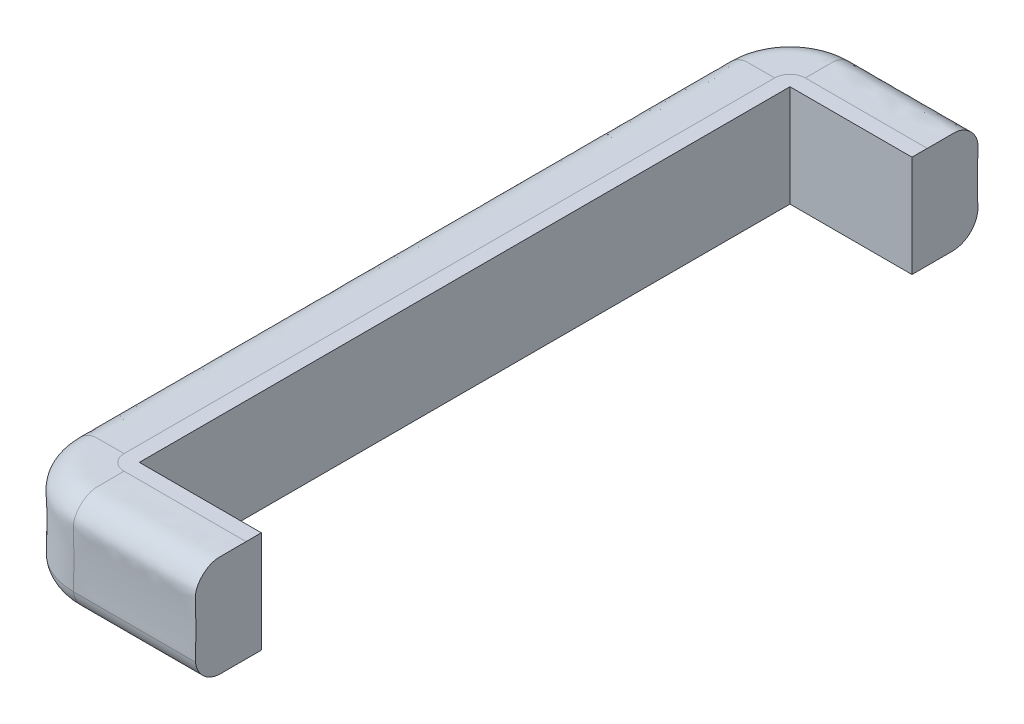
ISO-10303-21;
HEADER;
FILE_DESCRIPTION(('STEP AP214'),'2;1');
FILE_NAME('part.step','',(''),(''),'','','');
FILE_SCHEMA(('AUTOMOTIVE_DESIGN { 1 0 10303 214 1 1 1 1 }'));
ENDSEC;
DATA;
#1=APPLICATION_CONTEXT('core data for automotive mechanical design processes');
#2=APPLICATION_PROTOCOL_DEFINITION('international standard','automotive_design',2000,#1);
#3=PRODUCT_CONTEXT('',#1,'mechanical');
#4=PRODUCT('Part','Part','',(#3));
#5=PRODUCT_RELATED_PRODUCT_CATEGORY('part','',(#4));
#6=PRODUCT_DEFINITION_FORMATION('','',#4);
#7=PRODUCT_DEFINITION_CONTEXT('part definition',#1,'design');
#8=PRODUCT_DEFINITION('design','',#6,#7);
#9=PRODUCT_DEFINITION_SHAPE('','',#8);
#10=(LENGTH_UNIT() NAMED_UNIT(*) SI_UNIT(.MILLI.,.METRE.));
#11=(NAMED_UNIT(*) PLANE_ANGLE_UNIT() SI_UNIT($,.RADIAN.));
#12=(NAMED_UNIT(*) SI_UNIT($,.STERADIAN.) SOLID_ANGLE_UNIT());
#13=UNCERTAINTY_MEASURE_WITH_UNIT(LENGTH_MEASURE(1.E-05),#10,'distance_accuracy_value','');
#14=(GEOMETRIC_REPRESENTATION_CONTEXT(3) GLOBAL_UNCERTAINTY_ASSIGNED_CONTEXT((#13)) GLOBAL_UNIT_ASSIGNED_CONTEXT((#10,
#11,#12)) REPRESENTATION_CONTEXT('',''));
#15=CARTESIAN_POINT('',(0.,0.,0.));
#16=DIRECTION('',(0.,0.,1.));
#17=DIRECTION('',(1.,0.,0.));
#18=AXIS2_PLACEMENT_3D('',#15,#16,#17);
#19=CARTESIAN_POINT('',(0.,0.,812.8));
#20=DIRECTION('',(-1.,0.,0.));
#21=DIRECTION('',(0.,-1.,0.));
#22=AXIS2_PLACEMENT_3D('',#19,#20,#21);
#23=PLANE('',#22);
#24=DIRECTION('',(0.,-1.,0.));
#25=VECTOR('',#24,1.);
#26=CARTESIAN_POINT('',(0.,0.,0.));
#27=LINE('',#26,#25);
#28=CARTESIAN_POINT('',(0.,127.,0.));
#29=VERTEX_POINT('',#28);
#30=CARTESIAN_POINT('',(0.,0.,0.));
#31=VERTEX_POINT('',#30);
#32=EDGE_CURVE('E56',#29,#31,#27,.T.);
#33=ORIENTED_EDGE('',*,*,#32,.F.);
#34=DIRECTION('',(0.,0.,-1.));
#35=VECTOR('',#34,1.);
#36=CARTESIAN_POINT('',(0.,127.,812.8));
#37=LINE('',#36,#35);
#38=CARTESIAN_POINT('',(0.,127.,812.8));
#39=VERTEX_POINT('',#38);
#40=EDGE_CURVE('E173',#39,#29,#37,.T.);
#41=ORIENTED_EDGE('',*,*,#40,.F.);
#42=DIRECTION('',(0.,-1.,0.));
#43=VECTOR('',#42,1.);
#44=CARTESIAN_POINT('',(0.,0.,812.8));
#45=LINE('',#44,#43);
#46=CARTESIAN_POINT('',(0.,0.,812.8));
#47=VERTEX_POINT('',#46);
#48=EDGE_CURVE('E174',#39,#47,#45,.T.);
#49=ORIENTED_EDGE('',*,*,#48,.T.);
#50=DIRECTION('',(0.,0.,-1.));
#51=VECTOR('',#50,1.);
#52=CARTESIAN_POINT('',(0.,0.,812.8));
#53=LINE('',#52,#51);
#54=EDGE_CURVE('E52',#47,#31,#53,.T.);
#55=ORIENTED_EDGE('',*,*,#54,.T.);
#56=EDGE_LOOP('',(#33,#41,#49,#55));
#57=FACE_BOUND('',#56,.T.);
#58=ADVANCED_FACE('F36',(#57),#23,.F.);
#59=CARTESIAN_POINT('',(-19.05,127.,812.8));
#60=CARTESIAN_POINT('',(-25.8551548912427,127.,812.8));
#61=CARTESIAN_POINT('',(-41.6978192217573,126.779099710224,812.8));
#62=CARTESIAN_POINT('',(-65.8750714159513,127.401952543473,812.8));
#63=CARTESIAN_POINT('',(-83.5455443579168,110.861586710119,812.8));
#64=CARTESIAN_POINT('',(-81.483021395839,80.6655289043063,812.8));
#65=CARTESIAN_POINT('',(-81.4887588319644,44.9734172297453,812.8));
#66=CARTESIAN_POINT('',(-83.2203444761149,14.9744583315502,812.8));
#67=CARTESIAN_POINT('',(-68.5084229386176,-0.376359178511223,812.8));
#68=CARTESIAN_POINT('',(-39.2535015128502,0.21290615922689,812.8));
#69=CARTESIAN_POINT('',(-30.1777356571068,0.179241264312297,812.8));
#70=CARTESIAN_POINT('',(-19.0499999999995,0.,812.8));
#71=B_SPLINE_CURVE_WITH_KNOTS('',3,(#59,#60,#61,#62,#63,#64,#65,#66,#67,#68,#69,#70),
.UNSPECIFIED.,.F.,.F.,(4,1,1,1,1,1,1,1,1,4),(0.,0.126865214049549,0.164017914659121,
0.348470440380542,0.398266481918078,0.612182288496949,0.660910622989208,0.836821492348413,
0.872929315916482,1.),.UNSPECIFIED.);
#72=DIRECTION('',(0.,0.,-1.));
#73=VECTOR('',#72,1.);
#74=SURFACE_OF_LINEAR_EXTRUSION('',#71,#73);
#75=CARTESIAN_POINT('',(-19.05,127.,0.));
#76=CARTESIAN_POINT('',(-25.8551548912427,127.,0.));
#77=CARTESIAN_POINT('',(-41.6978192217573,126.779099710224,0.));
#78=CARTESIAN_POINT('',(-65.8750714159513,127.401952543473,0.));
#79=CARTESIAN_POINT('',(-83.5455443579168,110.861586710119,0.));
#80=CARTESIAN_POINT('',(-81.483021395839,80.6655289043063,0.));
#81=CARTESIAN_POINT('',(-81.4887588319644,44.9734172297453,0.));
#82=CARTESIAN_POINT('',(-83.2203444761149,14.9744583315502,0.));
#83=CARTESIAN_POINT('',(-68.5084229386176,-0.376359178511223,0.));
#84=CARTESIAN_POINT('',(-39.2535015128502,0.21290615922689,0.));
#85=CARTESIAN_POINT('',(-30.1777356571068,0.179241264312297,0.));
#86=CARTESIAN_POINT('',(-19.0499999999995,0.,0.));
#87=B_SPLINE_CURVE_WITH_KNOTS('',3,(#75,#76,#77,#78,#79,#80,#81,#82,#83,#84,#85,#86),
.UNSPECIFIED.,.F.,.F.,(4,1,1,1,1,1,1,1,1,4),(0.,0.126865214049549,0.164017914659121,
0.348470440380542,0.398266481918078,0.612182288496949,0.660910622989208,0.836821492348413,
0.872929315916482,1.),.UNSPECIFIED.);
#88=CARTESIAN_POINT('',(-19.05,127.,0.));
#89=VERTEX_POINT('',#88);
#90=CARTESIAN_POINT('',(-82.3555386809632,28.2413708440135,0.));
#91=VERTEX_POINT('',#90);
#92=EDGE_CURVE('E293',#89,#91,#87,.T.);
#93=ORIENTED_EDGE('',*,*,#92,.T.);
#94=DIRECTION('',(0.,0.,-1.));
#95=VECTOR('',#94,1.);
#96=CARTESIAN_POINT('',(-82.3555386809632,28.2413708440135,812.8));
#97=LINE('',#96,#95);
#98=CARTESIAN_POINT('',(-82.3555386809632,28.2413708440135,812.8));
#99=VERTEX_POINT('',#98);
#100=EDGE_CURVE('E11',#99,#91,#97,.T.);
#101=ORIENTED_EDGE('',*,*,#100,.F.);
#102=CARTESIAN_POINT('',(-19.05,127.,812.8));
#103=VERTEX_POINT('',#102);
#104=EDGE_CURVE('E294',#103,#99,#71,.T.);
#105=ORIENTED_EDGE('',*,*,#104,.F.);
#106=DIRECTION('',(0.,0.,-1.));
#107=VECTOR('',#106,1.);
#108=CARTESIAN_POINT('',(-19.05,127.,812.8));
#109=LINE('',#108,#107);
#110=EDGE_CURVE('E312',#103,#89,#109,.T.);
#111=ORIENTED_EDGE('',*,*,#110,.T.);
#112=EDGE_LOOP('',(#93,#101,#105,#111));
#113=FACE_BOUND('',#112,.T.);
#114=ADVANCED_FACE('F38',(#113),#74,.F.);
#115=CARTESIAN_POINT('',(-50.8,31.75,812.8));
#116=DIRECTION('',(0.,0.,-1.));
#117=DIRECTION('',(-1.,0.,0.));
#118=AXIS2_PLACEMENT_3D('',#115,#116,#117);
#119=CYLINDRICAL_SURFACE('',#118,31.75);
#120=CARTESIAN_POINT('',(-50.8,31.75,0.));
#121=DIRECTION('',(0.,0.,1.));
#122=DIRECTION('',(1.,0.,0.));
#123=AXIS2_PLACEMENT_3D('',#120,#121,#122);
#124=CIRCLE('',#123,31.75);
#125=CARTESIAN_POINT('',(-50.8,0.,0.));
#126=VERTEX_POINT('',#125);
#127=EDGE_CURVE('E590',#91,#126,#124,.T.);
#128=ORIENTED_EDGE('',*,*,#127,.T.);
#129=DIRECTION('',(0.,0.,-1.));
#130=VECTOR('',#129,1.);
#131=CARTESIAN_POINT('',(-50.8,0.,812.8));
#132=LINE('',#131,#130);
#133=CARTESIAN_POINT('',(-50.8,0.,812.8));
#134=VERTEX_POINT('',#133);
#135=EDGE_CURVE('E45',#134,#126,#132,.T.);
#136=ORIENTED_EDGE('',*,*,#135,.F.);
#137=CARTESIAN_POINT('',(-50.8,31.75,812.8));
#138=DIRECTION('',(0.,0.,1.));
#139=DIRECTION('',(1.,0.,0.));
#140=AXIS2_PLACEMENT_3D('',#137,#138,#139);
#141=CIRCLE('',#140,31.75);
#142=EDGE_CURVE('E300',#99,#134,#141,.T.);
#143=ORIENTED_EDGE('',*,*,#142,.F.);
#144=ORIENTED_EDGE('',*,*,#100,.T.);
#145=EDGE_LOOP('',(#128,#136,#143,#144));
#146=FACE_BOUND('',#145,.T.);
#147=ADVANCED_FACE('F324',(#146),#119,.T.);
#148=CARTESIAN_POINT('',(-19.05,127.,812.8));
#149=CARTESIAN_POINT('',(-25.8551548912427,127.,812.8));
#150=CARTESIAN_POINT('',(-41.6978192217573,126.779099710224,812.8));
#151=CARTESIAN_POINT('',(-65.8750714159513,127.401952543473,812.8));
#152=CARTESIAN_POINT('',(-83.5455443579168,110.861586710119,812.8));
#153=CARTESIAN_POINT('',(-81.483021395839,80.6655289043063,812.8));
#154=CARTESIAN_POINT('',(-81.4887588319644,44.9734172297453,812.8));
#155=CARTESIAN_POINT('',(-83.2203444761149,14.9744583315502,812.8));
#156=CARTESIAN_POINT('',(-68.5084229386176,-0.376359178511223,812.8));
#157=CARTESIAN_POINT('',(-39.2535015128502,0.21290615922689,812.8));
#158=CARTESIAN_POINT('',(-30.1777356571068,0.179241264312297,812.8));
#159=CARTESIAN_POINT('',(-19.0499999999995,0.,812.8));
#160=B_SPLINE_CURVE_WITH_KNOTS('',3,(#148,#149,#150,#151,#152,#153,#154,#155,#156,#157,#158,
#159),.UNSPECIFIED.,.F.,.F.,(4,1,1,1,1,1,1,1,1,4),(0.,0.126865214049549,0.164017914659121,
0.348470440380542,0.398266481918078,0.612182288496949,0.660910622989208,0.836821492348413,
0.872929315916482,1.),.UNSPECIFIED.);
#161=DIRECTION('',(0.,0.,-1.));
#162=VECTOR('',#161,1.);
#163=SURFACE_OF_LINEAR_EXTRUSION('',#160,#162);
#164=CARTESIAN_POINT('',(-19.05,127.,0.));
#165=CARTESIAN_POINT('',(-25.8551548912427,127.,0.));
#166=CARTESIAN_POINT('',(-41.6978192217573,126.779099710224,0.));
#167=CARTESIAN_POINT('',(-65.8750714159513,127.401952543473,0.));
#168=CARTESIAN_POINT('',(-83.5455443579168,110.861586710119,0.));
#169=CARTESIAN_POINT('',(-81.483021395839,80.6655289043063,0.));
#170=CARTESIAN_POINT('',(-81.4887588319644,44.9734172297453,0.));
#171=CARTESIAN_POINT('',(-83.2203444761149,14.9744583315502,0.));
#172=CARTESIAN_POINT('',(-68.5084229386176,-0.376359178511223,0.));
#173=CARTESIAN_POINT('',(-39.2535015128502,0.21290615922689,0.));
#174=CARTESIAN_POINT('',(-30.1777356571068,0.179241264312297,0.));
#175=CARTESIAN_POINT('',(-19.0499999999995,0.,0.));
#176=B_SPLINE_CURVE_WITH_KNOTS('',3,(#164,#165,#166,#167,#168,#169,#170,#171,#172,#173,#174,
#175),.UNSPECIFIED.,.F.,.F.,(4,1,1,1,1,1,1,1,1,4),(0.,0.126865214049549,0.164017914659121,
0.348470440380542,0.398266481918078,0.612182288496949,0.660910622989208,0.836821492348413,
0.872929315916482,1.),.UNSPECIFIED.);
#177=CARTESIAN_POINT('',(-34.8314397269733,0.15033500219797,0.));
#178=VERTEX_POINT('',#177);
#179=EDGE_CURVE('E301',#126,#178,#176,.T.);
#180=ORIENTED_EDGE('',*,*,#179,.T.);
#181=CARTESIAN_POINT('',(-19.0499999999995,0.,0.));
#182=CARTESIAN_POINT('',(-30.1777356571068,0.179241264312297,0.));
#183=CARTESIAN_POINT('',(-38.0305112085807,0.208369700185393,0.));
#184=CARTESIAN_POINT('',(-49.6283815073531,0.,0.));
#185=CARTESIAN_POINT('',(-50.8,0.,0.));
#186=B_SPLINE_CURVE_WITH_KNOTS('',3,(#181,#182,#183,#184,#185),.UNSPECIFIED.,.F.,.F.,(4,1,4),
(0.858810351018313,0.985881035101832,1.),.UNSPECIFIED.);
#187=CARTESIAN_POINT('',(-19.0499999999995,0.,0.));
#188=VERTEX_POINT('',#187);
#189=EDGE_CURVE('E225',#188,#178,#186,.T.);
#190=ORIENTED_EDGE('',*,*,#189,.F.);
#191=DIRECTION('',(0.,0.,-1.));
#192=VECTOR('',#191,1.);
#193=CARTESIAN_POINT('',(-19.05,0.,812.8));
#194=LINE('',#193,#192);
#195=CARTESIAN_POINT('',(-19.05,0.,812.8));
#196=VERTEX_POINT('',#195);
#197=EDGE_CURVE('E546',#196,#188,#194,.T.);
#198=ORIENTED_EDGE('',*,*,#197,.F.);
#199=EDGE_CURVE('E307',#134,#196,#160,.T.);
#200=ORIENTED_EDGE('',*,*,#199,.F.);
#201=ORIENTED_EDGE('',*,*,#135,.T.);
#202=EDGE_LOOP('',(#180,#190,#198,#200,#201));
#203=FACE_BOUND('',#202,.T.);
#204=ADVANCED_FACE('F320',(#203),#163,.F.);
#205=CARTESIAN_POINT('',(0.,0.,812.8));
#206=DIRECTION('',(0.,-1.,0.));
#207=DIRECTION('',(1.,0.,0.));
#208=AXIS2_PLACEMENT_3D('',#205,#206,#207);
#209=PLANE('',#208);
#210=ORIENTED_EDGE('',*,*,#197,.T.);
#211=CARTESIAN_POINT('',(0.,0.,0.));
#212=DIRECTION('',(0.,1.,0.));
#213=DIRECTION('',(-1.,0.,0.));
#214=AXIS2_PLACEMENT_3D('',#211,#212,#213);
#215=CIRCLE('',#214,19.0499999999995);
#216=CARTESIAN_POINT('',(0.,0.,-19.0499999999995));
#217=VERTEX_POINT('',#216);
#218=EDGE_CURVE('E244',#217,#188,#215,.T.);
#219=ORIENTED_EDGE('',*,*,#218,.F.);
#220=DIRECTION('',(-1.,0.,0.));
#221=VECTOR('',#220,1.);
#222=CARTESIAN_POINT('',(152.4,0.,-19.0499999999995));
#223=LINE('',#222,#221);
#224=CARTESIAN_POINT('',(152.4,0.,-19.0499999999995));
#225=VERTEX_POINT('',#224);
#226=EDGE_CURVE('E178',#225,#217,#223,.T.);
#227=ORIENTED_EDGE('',*,*,#226,.F.);
#228=DIRECTION('',(0.,0.,-1.));
#229=VECTOR('',#228,1.);
#230=CARTESIAN_POINT('',(152.4,0.,0.));
#231=LINE('',#230,#229);
#232=CARTESIAN_POINT('',(152.4,0.,0.));
#233=VERTEX_POINT('',#232);
#234=EDGE_CURVE('E160',#233,#225,#231,.T.);
#235=ORIENTED_EDGE('',*,*,#234,.F.);
#236=DIRECTION('',(-1.,0.,0.));
#237=VECTOR('',#236,1.);
#238=CARTESIAN_POINT('',(152.4,0.,0.));
#239=LINE('',#238,#237);
#240=EDGE_CURVE('E157',#233,#31,#239,.T.);
#241=ORIENTED_EDGE('',*,*,#240,.T.);
#242=ORIENTED_EDGE('',*,*,#54,.F.);
#243=DIRECTION('',(-1.,0.,0.));
#244=VECTOR('',#243,1.);
#245=CARTESIAN_POINT('',(152.4,0.,812.8));
#246=LINE('',#245,#244);
#247=CARTESIAN_POINT('',(152.4,0.,812.8));
#248=VERTEX_POINT('',#247);
#249=EDGE_CURVE('E570',#248,#47,#246,.T.);
#250=ORIENTED_EDGE('',*,*,#249,.F.);
#251=DIRECTION('',(0.,0.,-1.));
#252=VECTOR('',#251,1.);
#253=CARTESIAN_POINT('',(152.4,0.,0.));
#254=LINE('',#253,#252);
#255=CARTESIAN_POINT('',(152.4,0.,831.85));
#256=VERTEX_POINT('',#255);
#257=EDGE_CURVE('E566',#256,#248,#254,.T.);
#258=ORIENTED_EDGE('',*,*,#257,.F.);
#259=DIRECTION('',(-1.,0.,0.));
#260=VECTOR('',#259,1.);
#261=CARTESIAN_POINT('',(152.4,0.,831.85));
#262=LINE('',#261,#260);
#263=CARTESIAN_POINT('',(1.11022302462516E-13,0.,831.85));
#264=VERTEX_POINT('',#263);
#265=EDGE_CURVE('E574',#256,#264,#262,.T.);
#266=ORIENTED_EDGE('',*,*,#265,.T.);
#267=CARTESIAN_POINT('',(0.,0.,812.8));
#268=DIRECTION('',(0.,-1.,0.));
#269=DIRECTION('',(1.,0.,0.));
#270=AXIS2_PLACEMENT_3D('',#267,#268,#269);
#271=CIRCLE('',#270,19.0499999999996);
#272=EDGE_CURVE('E288',#264,#196,#271,.T.);
#273=ORIENTED_EDGE('',*,*,#272,.T.);
#274=EDGE_LOOP('',(#210,#219,#227,#235,#241,#242,#250,#258,#266,#273));
#275=FACE_BOUND('',#274,.T.);
#276=ADVANCED_FACE('F323',(#275),#209,.T.);
#277=CARTESIAN_POINT('',(0.,127.,812.8));
#278=DIRECTION('',(0.,-1.,0.));
#279=DIRECTION('',(0.,0.,-1.));
#280=AXIS2_PLACEMENT_3D('',#277,#278,#279);
#281=PLANE('',#280);
#282=CARTESIAN_POINT('',(0.,127.,812.8));
#283=DIRECTION('',(0.,-1.,0.));
#284=DIRECTION('',(1.,0.,0.));
#285=AXIS2_PLACEMENT_3D('',#282,#283,#284);
#286=CIRCLE('',#285,19.05);
#287=CARTESIAN_POINT('',(1.11022302462516E-13,127.,831.85));
#288=VERTEX_POINT('',#287);
#289=EDGE_CURVE('E291',#288,#103,#286,.T.);
#290=ORIENTED_EDGE('',*,*,#289,.F.);
#291=DIRECTION('',(-1.,0.,0.));
#292=VECTOR('',#291,1.);
#293=CARTESIAN_POINT('',(152.4,127.,831.85));
#294=LINE('',#293,#292);
#295=CARTESIAN_POINT('',(152.4,127.,831.85));
#296=VERTEX_POINT('',#295);
#297=EDGE_CURVE('E583',#296,#288,#294,.T.);
#298=ORIENTED_EDGE('',*,*,#297,.F.);
#299=DIRECTION('',(0.,0.,1.));
#300=VECTOR('',#299,1.);
#301=CARTESIAN_POINT('',(152.4,127.,0.));
#302=LINE('',#301,#300);
#303=CARTESIAN_POINT('',(152.4,127.,812.8));
#304=VERTEX_POINT('',#303);
#305=EDGE_CURVE('E184',#304,#296,#302,.T.);
#306=ORIENTED_EDGE('',*,*,#305,.F.);
#307=DIRECTION('',(-1.,0.,0.));
#308=VECTOR('',#307,1.);
#309=CARTESIAN_POINT('',(152.4,127.,812.8));
#310=LINE('',#309,#308);
#311=EDGE_CURVE('E585',#304,#39,#310,.T.);
#312=ORIENTED_EDGE('',*,*,#311,.T.);
#313=ORIENTED_EDGE('',*,*,#40,.T.);
#314=DIRECTION('',(-1.,0.,0.));
#315=VECTOR('',#314,1.);
#316=CARTESIAN_POINT('',(152.4,127.,0.));
#317=LINE('',#316,#315);
#318=CARTESIAN_POINT('',(152.4,127.,0.));
#319=VERTEX_POINT('',#318);
#320=EDGE_CURVE('E155',#319,#29,#317,.T.);
#321=ORIENTED_EDGE('',*,*,#320,.F.);
#322=DIRECTION('',(0.,0.,1.));
#323=VECTOR('',#322,1.);
#324=CARTESIAN_POINT('',(152.4,127.,0.));
#325=LINE('',#324,#323);
#326=CARTESIAN_POINT('',(152.4,127.,-19.05));
#327=VERTEX_POINT('',#326);
#328=EDGE_CURVE('E161',#327,#319,#325,.T.);
#329=ORIENTED_EDGE('',*,*,#328,.F.);
#330=DIRECTION('',(-1.,0.,0.));
#331=VECTOR('',#330,1.);
#332=CARTESIAN_POINT('',(152.4,127.,-19.05));
#333=LINE('',#332,#331);
#334=CARTESIAN_POINT('',(0.,127.,-19.05));
#335=VERTEX_POINT('',#334);
#336=EDGE_CURVE('E524',#327,#335,#333,.T.);
#337=ORIENTED_EDGE('',*,*,#336,.T.);
#338=CARTESIAN_POINT('',(0.,127.,0.));
#339=DIRECTION('',(0.,1.,0.));
#340=DIRECTION('',(-1.,0.,0.));
#341=AXIS2_PLACEMENT_3D('',#338,#339,#340);
#342=CIRCLE('',#341,19.05);
#343=EDGE_CURVE('E242',#335,#89,#342,.T.);
#344=ORIENTED_EDGE('',*,*,#343,.T.);
#345=ORIENTED_EDGE('',*,*,#110,.F.);
#346=EDGE_LOOP('',(#290,#298,#306,#312,#313,#321,#329,#337,#344,#345));
#347=FACE_BOUND('',#346,.T.);
#348=ADVANCED_FACE('F171',(#347),#281,.F.);
#349=CARTESIAN_POINT('',(1.11022302462516E-13,127.,831.85));
#350=CARTESIAN_POINT('',(1.11022302462516E-13,127.,838.655154891243));
#351=CARTESIAN_POINT('',(1.11022302462516E-13,126.779099710224,854.497819221757));
#352=CARTESIAN_POINT('',(2.22044604925031E-13,127.401952543473,878.675071415951));
#353=CARTESIAN_POINT('',(3.33066907387547E-13,110.861586710119,896.345544357917));
#354=CARTESIAN_POINT('',(3.33066907387547E-13,80.6655289043063,894.283021395839));
#355=CARTESIAN_POINT('',(3.33066907387547E-13,47.4853502106105,894.288355043722));
#356=CARTESIAN_POINT('',(3.33066907387547E-13,30.1001128078637,895.159373774834));
#357=CARTESIAN_POINT('',(3.33066907387547E-13,28.2413708440135,895.155538680963));
#358=B_SPLINE_CURVE_WITH_KNOTS('',3,(#349,#350,#351,#352,#353,#354,#355,#356,#357),
.UNSPECIFIED.,.F.,.F.,(4,1,1,1,1,1,4),(0.,0.126865214049549,0.164017914659121,0.348470440380542,
0.398266481918078,0.612182288496949,0.638921764319307),.UNSPECIFIED.);
#359=CARTESIAN_POINT('',(0.,0.,812.8));
#360=DIRECTION('',(0.,-1.,0.));
#361=AXIS1_PLACEMENT('',#359,#360);
#362=SURFACE_OF_REVOLUTION('',#358,#361);
#363=ORIENTED_EDGE('',*,*,#289,.T.);
#364=ORIENTED_EDGE('',*,*,#104,.T.);
#365=CARTESIAN_POINT('',(0.,28.2413708440135,812.8));
#366=DIRECTION('',(0.,-1.,0.));
#367=DIRECTION('',(1.,0.,0.));
#368=AXIS2_PLACEMENT_3D('',#365,#366,#367);
#369=CIRCLE('',#368,82.3555386809632);
#370=CARTESIAN_POINT('',(3.33066907387547E-13,28.2413708440135,895.155538680963));
#371=VERTEX_POINT('',#370);
#372=EDGE_CURVE('E279',#371,#99,#369,.T.);
#373=ORIENTED_EDGE('',*,*,#372,.F.);
#374=EDGE_CURVE('E251',#288,#371,#358,.T.);
#375=ORIENTED_EDGE('',*,*,#374,.F.);
#376=EDGE_LOOP('',(#363,#364,#373,#375));
#377=FACE_BOUND('',#376,.T.);
#378=ADVANCED_FACE('F262',(#377),#362,.T.);
#379=CARTESIAN_POINT('',(2.22044604925031E-13,0.,863.6));
#380=CARTESIAN_POINT('',(2.22044604925031E-13,0.,862.428381507353));
#381=CARTESIAN_POINT('',(1.11022302462516E-13,0.208369700185391,850.830511208581));
#382=CARTESIAN_POINT('',(1.11022302462516E-13,0.179241264312296,842.977735657107));
#383=CARTESIAN_POINT('',(1.11022302462516E-13,0.,831.85));
#384=B_SPLINE_CURVE_WITH_KNOTS('',3,(#379,#380,#381,#382,#383),.UNSPECIFIED.,.F.,.F.,(4,1,4),
(0.858810351018313,0.872929315916482,1.),.UNSPECIFIED.);
#385=CARTESIAN_POINT('',(0.,0.,812.8));
#386=DIRECTION('',(0.,-1.,0.));
#387=AXIS1_PLACEMENT('',#385,#386);
#388=SURFACE_OF_REVOLUTION('',#384,#387);
#389=CARTESIAN_POINT('',(0.,0.,812.8));
#390=DIRECTION('',(0.,-1.,0.));
#391=DIRECTION('',(1.,0.,0.));
#392=AXIS2_PLACEMENT_3D('',#389,#390,#391);
#393=CIRCLE('',#392,50.8000000000001);
#394=CARTESIAN_POINT('',(0.,0.,863.6));
#395=VERTEX_POINT('',#394);
#396=EDGE_CURVE('E285',#395,#134,#393,.T.);
#397=ORIENTED_EDGE('',*,*,#396,.T.);
#398=ORIENTED_EDGE('',*,*,#199,.T.);
#399=ORIENTED_EDGE('',*,*,#272,.F.);
#400=EDGE_CURVE('E274',#395,#264,#384,.T.);
#401=ORIENTED_EDGE('',*,*,#400,.F.);
#402=EDGE_LOOP('',(#397,#398,#399,#401));
#403=FACE_BOUND('',#402,.T.);
#404=ADVANCED_FACE('F265',(#403),#388,.T.);
#405=CARTESIAN_POINT('',(0.,31.75,812.8));
#406=DIRECTION('',(0.,-1.,0.));
#407=DIRECTION('',(1.,0.,0.));
#408=AXIS2_PLACEMENT_3D('',#405,#406,#407);
#409=TOROIDAL_SURFACE('',#408,50.8000000000001,31.75);
#410=CARTESIAN_POINT('',(2.22044604925031E-13,31.75,863.6));
#411=DIRECTION('',(1.,0.,0.));
#412=DIRECTION('',(0.,0.,-1.));
#413=AXIS2_PLACEMENT_3D('',#410,#411,#412);
#414=CIRCLE('',#413,31.75);
#415=EDGE_CURVE('E256',#371,#395,#414,.T.);
#416=ORIENTED_EDGE('',*,*,#415,.F.);
#417=ORIENTED_EDGE('',*,*,#372,.T.);
#418=ORIENTED_EDGE('',*,*,#142,.T.);
#419=ORIENTED_EDGE('',*,*,#396,.F.);
#420=EDGE_LOOP('',(#416,#417,#418,#419));
#421=FACE_BOUND('',#420,.T.);
#422=ADVANCED_FACE('F214',(#421),#409,.T.);
#423=CARTESIAN_POINT('',(2.88882920460369E-13,28.2413708440135,-82.3555386809632));
#424=CARTESIAN_POINT('',(2.88984510620996E-13,30.1001128078637,-82.3593737748338));
#425=CARTESIAN_POINT('',(2.86768319704356E-13,47.4853502106105,-81.4883550437224));
#426=CARTESIAN_POINT('',(2.88324144973008E-13,80.6655289043063,-81.483021395839));
#427=CARTESIAN_POINT('',(2.96958252142698E-13,110.861586710119,-83.5455443579168));
#428=CARTESIAN_POINT('',(2.36046989964815E-13,127.401952543473,-65.8750714159513));
#429=CARTESIAN_POINT('',(1.51603009834012E-13,126.779099710224,-41.6978192217573));
#430=CARTESIAN_POINT('',(0.,127.,-25.8551548912427));
#431=CARTESIAN_POINT('',(0.,127.,-19.05));
#432=B_SPLINE_CURVE_WITH_KNOTS('',3,(#423,#424,#425,#426,#427,#428,#429,#430,#431),
.UNSPECIFIED.,.F.,.F.,(4,1,1,1,1,1,4),(0.,0.0267394758223581,0.240655282401229,
0.290451323938765,0.474903849660185,0.512056550269757,0.638921764319307),.UNSPECIFIED.);
#433=CARTESIAN_POINT('',(0.,127.,0.));
#434=DIRECTION('',(0.,1.,0.));
#435=AXIS1_PLACEMENT('',#433,#434);
#436=SURFACE_OF_REVOLUTION('',#432,#435);
#437=CARTESIAN_POINT('',(0.,28.2413708440135,0.));
#438=DIRECTION('',(0.,1.,0.));
#439=DIRECTION('',(-1.,0.,0.));
#440=AXIS2_PLACEMENT_3D('',#437,#438,#439);
#441=CIRCLE('',#440,82.3555386809632);
#442=CARTESIAN_POINT('',(2.88882920460369E-13,28.2413708440135,-82.3555386809632));
#443=VERTEX_POINT('',#442);
#444=EDGE_CURVE('E249',#443,#91,#441,.T.);
#445=ORIENTED_EDGE('',*,*,#444,.T.);
#446=ORIENTED_EDGE('',*,*,#92,.F.);
#447=ORIENTED_EDGE('',*,*,#343,.F.);
#448=EDGE_CURVE('E218',#443,#335,#432,.T.);
#449=ORIENTED_EDGE('',*,*,#448,.F.);
#450=EDGE_LOOP('',(#445,#446,#447,#449));
#451=FACE_BOUND('',#450,.T.);
#452=ADVANCED_FACE('F209',(#451),#436,.T.);
#453=CARTESIAN_POINT('',(0.,31.75,0.));
#454=DIRECTION('',(0.,1.,0.));
#455=DIRECTION('',(-1.,0.,0.));
#456=AXIS2_PLACEMENT_3D('',#453,#454,#455);
#457=TOROIDAL_SURFACE('',#456,50.8,31.75);
#458=CARTESIAN_POINT('',(0.,0.,0.));
#459=DIRECTION('',(0.,1.,0.));
#460=DIRECTION('',(-1.,0.,0.));
#461=AXIS2_PLACEMENT_3D('',#458,#459,#460);
#462=CIRCLE('',#461,50.8);
#463=CARTESIAN_POINT('',(1.77367252013231E-13,0.,-50.8));
#464=VERTEX_POINT('',#463);
#465=EDGE_CURVE('E246',#464,#126,#462,.T.);
#466=ORIENTED_EDGE('',*,*,#465,.T.);
#467=ORIENTED_EDGE('',*,*,#127,.F.);
#468=ORIENTED_EDGE('',*,*,#444,.F.);
#469=CARTESIAN_POINT('',(1.7887383556071E-13,31.75,-50.8));
#470=DIRECTION('',(1.,0.,0.));
#471=DIRECTION('',(0.,0.,-1.));
#472=AXIS2_PLACEMENT_3D('',#469,#470,#471);
#473=CIRCLE('',#472,31.75);
#474=EDGE_CURVE('E236',#464,#443,#473,.T.);
#475=ORIENTED_EDGE('',*,*,#474,.F.);
#476=EDGE_LOOP('',(#466,#467,#468,#475));
#477=FACE_BOUND('',#476,.T.);
#478=ADVANCED_FACE('F213',(#477),#457,.T.);
#479=CARTESIAN_POINT('',(0.,0.,-19.0499999999995));
#480=CARTESIAN_POINT('',(1.05373506153277E-13,0.179241264312296,-30.1777356571068));
#481=CARTESIAN_POINT('',(1.32792707635899E-13,0.208369700185391,-38.0305112085807));
#482=CARTESIAN_POINT('',(1.73276567909911E-13,0.,-49.6283815073531));
#483=CARTESIAN_POINT('',(1.77367252013231E-13,0.,-50.8));
#484=B_SPLINE_CURVE_WITH_KNOTS('',3,(#479,#480,#481,#482,#483),.UNSPECIFIED.,.F.,.F.,(4,1,4),
(0.858810351018313,0.985881035101832,1.),.UNSPECIFIED.);
#485=CARTESIAN_POINT('',(0.,127.,0.));
#486=DIRECTION('',(0.,1.,0.));
#487=AXIS1_PLACEMENT('',#485,#486);
#488=SURFACE_OF_REVOLUTION('',#484,#487);
#489=ORIENTED_EDGE('',*,*,#218,.T.);
#490=ORIENTED_EDGE('',*,*,#189,.T.);
#491=ORIENTED_EDGE('',*,*,#179,.F.);
#492=ORIENTED_EDGE('',*,*,#465,.F.);
#493=EDGE_CURVE('E224',#217,#464,#484,.T.);
#494=ORIENTED_EDGE('',*,*,#493,.F.);
#495=EDGE_LOOP('',(#489,#490,#491,#492,#494));
#496=FACE_BOUND('',#495,.T.);
#497=ADVANCED_FACE('F207',(#496),#488,.T.);
#498=CARTESIAN_POINT('',(152.4,0.,812.8));
#499=DIRECTION('',(0.,0.,-1.));
#500=DIRECTION('',(-1.,0.,0.));
#501=AXIS2_PLACEMENT_3D('',#498,#499,#500);
#502=PLANE('',#501);
#503=ORIENTED_EDGE('',*,*,#48,.F.);
#504=ORIENTED_EDGE('',*,*,#311,.F.);
#505=DIRECTION('',(0.,-1.,0.));
#506=VECTOR('',#505,1.);
#507=CARTESIAN_POINT('',(152.4,0.,812.8));
#508=LINE('',#507,#506);
#509=EDGE_CURVE('E176',#304,#248,#508,.T.);
#510=ORIENTED_EDGE('',*,*,#509,.T.);
#511=ORIENTED_EDGE('',*,*,#249,.T.);
#512=EDGE_LOOP('',(#503,#504,#510,#511));
#513=FACE_BOUND('',#512,.T.);
#514=ADVANCED_FACE('F202',(#513),#502,.T.);
#515=CARTESIAN_POINT('',(152.4,127.,831.85));
#516=CARTESIAN_POINT('',(152.4,127.,838.655154891243));
#517=CARTESIAN_POINT('',(152.4,126.779099710224,854.497819221757));
#518=CARTESIAN_POINT('',(152.4,127.401952543473,878.675071415951));
#519=CARTESIAN_POINT('',(152.4,110.861586710119,896.345544357917));
#520=CARTESIAN_POINT('',(152.4,80.6655289043063,894.283021395839));
#521=CARTESIAN_POINT('',(152.4,47.4853502106105,894.288355043722));
#522=CARTESIAN_POINT('',(152.4,30.1001128078637,895.159373774834));
#523=CARTESIAN_POINT('',(152.4,28.2413708440135,895.155538680963));
#524=B_SPLINE_CURVE_WITH_KNOTS('',3,(#515,#516,#517,#518,#519,#520,#521,#522,#523),
.UNSPECIFIED.,.F.,.F.,(4,1,1,1,1,1,4),(0.,0.126865214049549,0.164017914659121,0.348470440380542,
0.398266481918078,0.612182288496949,0.638921764319307),.UNSPECIFIED.);
#525=DIRECTION('',(-1.,0.,0.));
#526=VECTOR('',#525,1.);
#527=SURFACE_OF_LINEAR_EXTRUSION('',#524,#526);
#528=ORIENTED_EDGE('',*,*,#374,.T.);
#529=DIRECTION('',(-1.,0.,0.));
#530=VECTOR('',#529,1.);
#531=CARTESIAN_POINT('',(152.4,28.2413708440135,895.155538680963));
#532=LINE('',#531,#530);
#533=CARTESIAN_POINT('',(152.4,28.2413708440135,895.155538680963));
#534=VERTEX_POINT('',#533);
#535=EDGE_CURVE('E580',#534,#371,#532,.T.);
#536=ORIENTED_EDGE('',*,*,#535,.F.);
#537=EDGE_CURVE('E186',#296,#534,#524,.T.);
#538=ORIENTED_EDGE('',*,*,#537,.F.);
#539=ORIENTED_EDGE('',*,*,#297,.T.);
#540=EDGE_LOOP('',(#528,#536,#538,#539));
#541=FACE_BOUND('',#540,.T.);
#542=ADVANCED_FACE('F197',(#541),#527,.F.);
#543=CARTESIAN_POINT('',(152.4,31.75,863.6));
#544=DIRECTION('',(-1.,0.,0.));
#545=DIRECTION('',(0.,-1.,0.));
#546=AXIS2_PLACEMENT_3D('',#543,#544,#545);
#547=CYLINDRICAL_SURFACE('',#546,31.75);
#548=ORIENTED_EDGE('',*,*,#415,.T.);
#549=DIRECTION('',(-1.,0.,0.));
#550=VECTOR('',#549,1.);
#551=CARTESIAN_POINT('',(152.4,0.,863.6));
#552=LINE('',#551,#550);
#553=CARTESIAN_POINT('',(152.4,0.,863.6));
#554=VERTEX_POINT('',#553);
#555=EDGE_CURVE('E577',#554,#395,#552,.T.);
#556=ORIENTED_EDGE('',*,*,#555,.F.);
#557=CARTESIAN_POINT('',(152.4,31.75,863.6));
#558=DIRECTION('',(1.,0.,0.));
#559=DIRECTION('',(0.,1.,0.));
#560=AXIS2_PLACEMENT_3D('',#557,#558,#559);
#561=CIRCLE('',#560,31.75);
#562=EDGE_CURVE('E191',#534,#554,#561,.T.);
#563=ORIENTED_EDGE('',*,*,#562,.F.);
#564=ORIENTED_EDGE('',*,*,#535,.T.);
#565=EDGE_LOOP('',(#548,#556,#563,#564));
#566=FACE_BOUND('',#565,.T.);
#567=ADVANCED_FACE('F201',(#566),#547,.T.);
#568=CARTESIAN_POINT('',(152.4,0.,863.6));
#569=CARTESIAN_POINT('',(152.4,0.,862.428381507353));
#570=CARTESIAN_POINT('',(152.4,0.208369700185384,850.830511208581));
#571=CARTESIAN_POINT('',(152.4,0.179241264312288,842.977735657107));
#572=CARTESIAN_POINT('',(152.4,0.,831.85));
#573=B_SPLINE_CURVE_WITH_KNOTS('',3,(#568,#569,#570,#571,#572),.UNSPECIFIED.,.F.,.F.,(4,1,4),
(0.858810351018313,0.872929315916482,1.),.UNSPECIFIED.);
#574=DIRECTION('',(-1.,0.,0.));
#575=VECTOR('',#574,1.);
#576=SURFACE_OF_LINEAR_EXTRUSION('',#573,#575);
#577=ORIENTED_EDGE('',*,*,#400,.T.);
#578=ORIENTED_EDGE('',*,*,#265,.F.);
#579=EDGE_CURVE('E561',#554,#256,#573,.T.);
#580=ORIENTED_EDGE('',*,*,#579,.F.);
#581=ORIENTED_EDGE('',*,*,#555,.T.);
#582=EDGE_LOOP('',(#577,#578,#580,#581));
#583=FACE_BOUND('',#582,.T.);
#584=ADVANCED_FACE('F446',(#583),#576,.F.);
#585=CARTESIAN_POINT('',(152.4,0.,0.));
#586=DIRECTION('',(1.,0.,0.));
#587=DIRECTION('',(0.,1.,0.));
#588=AXIS2_PLACEMENT_3D('',#585,#586,#587);
#589=PLANE('',#588);
#590=ORIENTED_EDGE('',*,*,#509,.F.);
#591=ORIENTED_EDGE('',*,*,#305,.T.);
#592=ORIENTED_EDGE('',*,*,#537,.T.);
#593=ORIENTED_EDGE('',*,*,#562,.T.);
#594=ORIENTED_EDGE('',*,*,#579,.T.);
#595=ORIENTED_EDGE('',*,*,#257,.T.);
#596=EDGE_LOOP('',(#590,#591,#592,#593,#594,#595));
#597=FACE_BOUND('',#596,.T.);
#598=ADVANCED_FACE('F456',(#597),#589,.T.);
#599=CARTESIAN_POINT('',(152.4,0.,0.));
#600=DIRECTION('',(0.,0.,-1.));
#601=DIRECTION('',(0.,1.,0.));
#602=AXIS2_PLACEMENT_3D('',#599,#600,#601);
#603=PLANE('',#602);
#604=ORIENTED_EDGE('',*,*,#32,.T.);
#605=ORIENTED_EDGE('',*,*,#240,.F.);
#606=DIRECTION('',(0.,-1.,0.));
#607=VECTOR('',#606,1.);
#608=CARTESIAN_POINT('',(152.4,0.,0.));
#609=LINE('',#608,#607);
#610=EDGE_CURVE('E151',#319,#233,#609,.T.);
#611=ORIENTED_EDGE('',*,*,#610,.F.);
#612=ORIENTED_EDGE('',*,*,#320,.T.);
#613=EDGE_LOOP('',(#604,#605,#611,#612));
#614=FACE_BOUND('',#613,.T.);
#615=ADVANCED_FACE('F153',(#614),#603,.F.);
#616=CARTESIAN_POINT('',(152.4,0.,-19.0499999999995));
#617=CARTESIAN_POINT('',(152.4,0.179241264312288,-30.1777356571068));
#618=CARTESIAN_POINT('',(152.4,0.208369700185384,-38.0305112085807));
#619=CARTESIAN_POINT('',(152.4,0.,-49.6283815073531));
#620=CARTESIAN_POINT('',(152.4,0.,-50.8));
#621=B_SPLINE_CURVE_WITH_KNOTS('',3,(#616,#617,#618,#619,#620),.UNSPECIFIED.,.F.,.F.,(4,1,4),
(0.858810351018313,0.985881035101832,1.),.UNSPECIFIED.);
#622=DIRECTION('',(-1.,0.,0.));
#623=VECTOR('',#622,1.);
#624=SURFACE_OF_LINEAR_EXTRUSION('',#621,#623);
#625=ORIENTED_EDGE('',*,*,#493,.T.);
#626=DIRECTION('',(-1.,0.,0.));
#627=VECTOR('',#626,1.);
#628=CARTESIAN_POINT('',(152.4,0.,-50.8));
#629=LINE('',#628,#627);
#630=CARTESIAN_POINT('',(152.4,0.,-50.8));
#631=VERTEX_POINT('',#630);
#632=EDGE_CURVE('E535',#631,#464,#629,.T.);
#633=ORIENTED_EDGE('',*,*,#632,.F.);
#634=EDGE_CURVE('E543',#225,#631,#621,.T.);
#635=ORIENTED_EDGE('',*,*,#634,.F.);
#636=ORIENTED_EDGE('',*,*,#226,.T.);
#637=EDGE_LOOP('',(#625,#633,#635,#636));
#638=FACE_BOUND('',#637,.T.);
#639=ADVANCED_FACE('F474',(#638),#624,.F.);
#640=CARTESIAN_POINT('',(152.4,31.75,-50.8));
#641=DIRECTION('',(-1.,0.,0.));
#642=DIRECTION('',(0.,-1.,0.));
#643=AXIS2_PLACEMENT_3D('',#640,#641,#642);
#644=CYLINDRICAL_SURFACE('',#643,31.75);
#645=ORIENTED_EDGE('',*,*,#474,.T.);
#646=DIRECTION('',(-1.,0.,0.));
#647=VECTOR('',#646,1.);
#648=CARTESIAN_POINT('',(152.4,28.2413708440135,-82.3555386809632));
#649=LINE('',#648,#647);
#650=CARTESIAN_POINT('',(152.4,28.2413708440135,-82.3555386809632));
#651=VERTEX_POINT('',#650);
#652=EDGE_CURVE('E532',#651,#443,#649,.T.);
#653=ORIENTED_EDGE('',*,*,#652,.F.);
#654=CARTESIAN_POINT('',(152.4,31.75,-50.8));
#655=DIRECTION('',(1.,0.,0.));
#656=DIRECTION('',(0.,1.,0.));
#657=AXIS2_PLACEMENT_3D('',#654,#655,#656);
#658=CIRCLE('',#657,31.75);
#659=EDGE_CURVE('E525',#631,#651,#658,.T.);
#660=ORIENTED_EDGE('',*,*,#659,.F.);
#661=ORIENTED_EDGE('',*,*,#632,.T.);
#662=EDGE_LOOP('',(#645,#653,#660,#661));
#663=FACE_BOUND('',#662,.T.);
#664=ADVANCED_FACE('F484',(#663),#644,.T.);
#665=CARTESIAN_POINT('',(152.4,28.2413708440135,-82.3555386809632));
#666=CARTESIAN_POINT('',(152.4,30.1001128078637,-82.3593737748338));
#667=CARTESIAN_POINT('',(152.4,47.4853502106105,-81.4883550437224));
#668=CARTESIAN_POINT('',(152.4,80.6655289043063,-81.483021395839));
#669=CARTESIAN_POINT('',(152.4,110.861586710119,-83.5455443579168));
#670=CARTESIAN_POINT('',(152.4,127.401952543473,-65.8750714159513));
#671=CARTESIAN_POINT('',(152.4,126.779099710224,-41.6978192217573));
#672=CARTESIAN_POINT('',(152.4,127.,-25.8551548912427));
#673=CARTESIAN_POINT('',(152.4,127.,-19.05));
#674=B_SPLINE_CURVE_WITH_KNOTS('',3,(#665,#666,#667,#668,#669,#670,#671,#672,#673),
.UNSPECIFIED.,.F.,.F.,(4,1,1,1,1,1,4),(0.,0.0267394758223581,0.240655282401229,
0.290451323938765,0.474903849660185,0.512056550269757,0.638921764319307),.UNSPECIFIED.);
#675=DIRECTION('',(-1.,0.,0.));
#676=VECTOR('',#675,1.);
#677=SURFACE_OF_LINEAR_EXTRUSION('',#674,#676);
#678=ORIENTED_EDGE('',*,*,#448,.T.);
#679=ORIENTED_EDGE('',*,*,#336,.F.);
#680=EDGE_CURVE('E166',#651,#327,#674,.T.);
#681=ORIENTED_EDGE('',*,*,#680,.F.);
#682=ORIENTED_EDGE('',*,*,#652,.T.);
#683=EDGE_LOOP('',(#678,#679,#681,#682));
#684=FACE_BOUND('',#683,.T.);
#685=ADVANCED_FACE('F495',(#684),#677,.F.);
#686=CARTESIAN_POINT('',(152.4,0.,0.));
#687=DIRECTION('',(1.,0.,0.));
#688=DIRECTION('',(0.,1.,0.));
#689=AXIS2_PLACEMENT_3D('',#686,#687,#688);
#690=PLANE('',#689);
#691=ORIENTED_EDGE('',*,*,#328,.T.);
#692=ORIENTED_EDGE('',*,*,#610,.T.);
#693=ORIENTED_EDGE('',*,*,#234,.T.);
#694=ORIENTED_EDGE('',*,*,#634,.T.);
#695=ORIENTED_EDGE('',*,*,#659,.T.);
#696=ORIENTED_EDGE('',*,*,#680,.T.);
#697=EDGE_LOOP('',(#691,#692,#693,#694,#695,#696));
#698=FACE_BOUND('',#697,.T.);
#699=ADVANCED_FACE('F164',(#698),#690,.T.);
#700=CLOSED_SHELL('',(#58,#114,#147,#204,#276,#348,#378,#404,#422,#452,#478,#497,#514,#542,#567,
#584,#598,#615,#639,#664,#685,#699));
#701=MANIFOLD_SOLID_BREP('B2',#700);
#702=ADVANCED_BREP_SHAPE_REPRESENTATION('',(#18,#701),#14);
#703=SHAPE_DEFINITION_REPRESENTATION(#9,#702);
ENDSEC;
END-ISO-10303-21;
